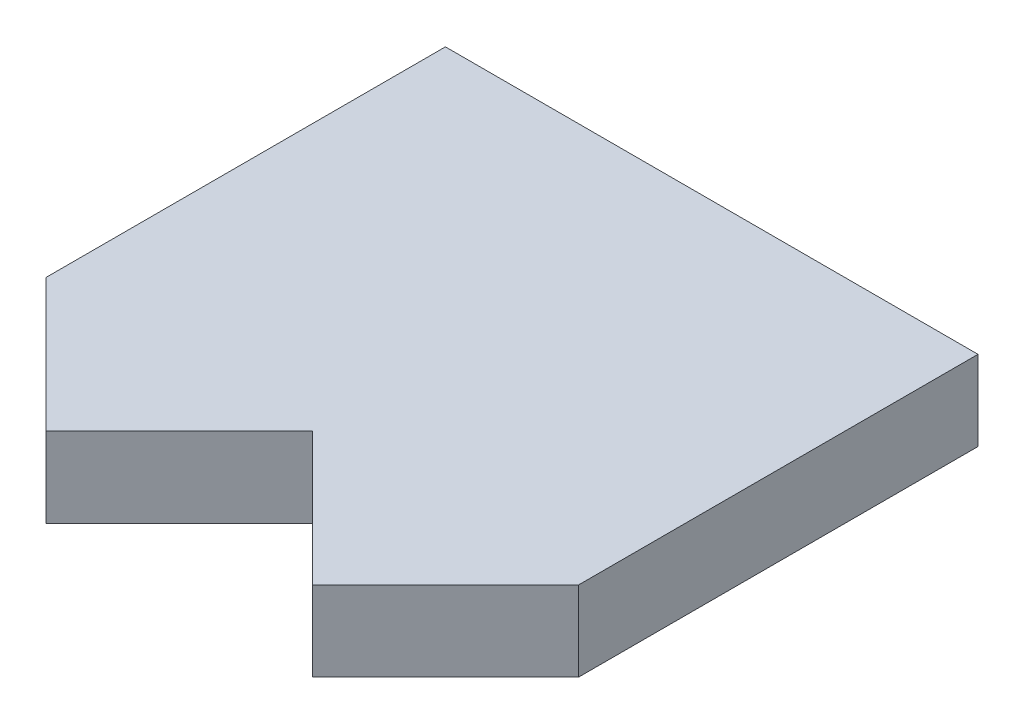
ISO-10303-21;
HEADER;
FILE_DESCRIPTION(('STEP AP214'),'2;1');
FILE_NAME('part.step','',(''),(''),'','','');
FILE_SCHEMA(('AUTOMOTIVE_DESIGN { 1 0 10303 214 1 1 1 1 }'));
ENDSEC;
DATA;
#1=APPLICATION_CONTEXT('core data for automotive mechanical design processes');
#2=APPLICATION_PROTOCOL_DEFINITION('international standard','automotive_design',2000,#1);
#3=PRODUCT_CONTEXT('',#1,'mechanical');
#4=PRODUCT('Part','Part','',(#3));
#5=PRODUCT_RELATED_PRODUCT_CATEGORY('part','',(#4));
#6=PRODUCT_DEFINITION_FORMATION('','',#4);
#7=PRODUCT_DEFINITION_CONTEXT('part definition',#1,'design');
#8=PRODUCT_DEFINITION('design','',#6,#7);
#9=PRODUCT_DEFINITION_SHAPE('','',#8);
#10=(LENGTH_UNIT() NAMED_UNIT(*) SI_UNIT(.MILLI.,.METRE.));
#11=(NAMED_UNIT(*) PLANE_ANGLE_UNIT() SI_UNIT($,.RADIAN.));
#12=(NAMED_UNIT(*) SI_UNIT($,.STERADIAN.) SOLID_ANGLE_UNIT());
#13=UNCERTAINTY_MEASURE_WITH_UNIT(LENGTH_MEASURE(1.E-05),#10,'distance_accuracy_value','');
#14=(GEOMETRIC_REPRESENTATION_CONTEXT(3) GLOBAL_UNCERTAINTY_ASSIGNED_CONTEXT((#13)) GLOBAL_UNIT_ASSIGNED_CONTEXT((#10,
#11,#12)) REPRESENTATION_CONTEXT('',''));
#15=CARTESIAN_POINT('',(0.,0.,0.));
#16=DIRECTION('',(0.,0.,1.));
#17=DIRECTION('',(1.,0.,0.));
#18=AXIS2_PLACEMENT_3D('',#15,#16,#17);
#19=CARTESIAN_POINT('',(0.,3.,0.));
#20=DIRECTION('',(0.,-1.,0.));
#21=DIRECTION('',(0.,0.,-1.));
#22=AXIS2_PLACEMENT_3D('',#19,#20,#21);
#23=PLANE('',#22);
#24=DIRECTION('',(-0.707106781186548,0.,-0.707106781186547));
#25=VECTOR('',#24,1.);
#26=CARTESIAN_POINT('',(-2.5,3.,2.5));
#27=LINE('',#26,#25);
#28=CARTESIAN_POINT('',(5.,3.,9.99999999999999));
#29=VERTEX_POINT('',#28);
#30=CARTESIAN_POINT('',(0.,3.,5.));
#31=VERTEX_POINT('',#30);
#32=EDGE_CURVE('E180',#29,#31,#27,.T.);
#33=ORIENTED_EDGE('',*,*,#32,.F.);
#34=DIRECTION('',(-0.707106781186548,0.,0.707106781186548));
#35=VECTOR('',#34,1.);
#36=CARTESIAN_POINT('',(7.5,3.,7.5));
#37=LINE('',#36,#35);
#38=CARTESIAN_POINT('',(10.,3.,5.));
#39=VERTEX_POINT('',#38);
#40=EDGE_CURVE('E170',#39,#29,#37,.T.);
#41=ORIENTED_EDGE('',*,*,#40,.F.);
#42=DIRECTION('',(0.,0.,-1.));
#43=VECTOR('',#42,1.);
#44=CARTESIAN_POINT('',(10.,3.,10.));
#45=LINE('',#44,#43);
#46=CARTESIAN_POINT('',(10.,3.,-10.));
#47=VERTEX_POINT('',#46);
#48=EDGE_CURVE('E161',#39,#47,#45,.T.);
#49=ORIENTED_EDGE('',*,*,#48,.T.);
#50=DIRECTION('',(-1.,0.,0.));
#51=VECTOR('',#50,1.);
#52=CARTESIAN_POINT('',(-10.,3.,-10.));
#53=LINE('',#52,#51);
#54=CARTESIAN_POINT('',(-10.,3.,-10.));
#55=VERTEX_POINT('',#54);
#56=EDGE_CURVE('E130',#47,#55,#53,.T.);
#57=ORIENTED_EDGE('',*,*,#56,.T.);
#58=DIRECTION('',(0.,0.,1.));
#59=VECTOR('',#58,1.);
#60=CARTESIAN_POINT('',(-10.,3.,10.));
#61=LINE('',#60,#59);
#62=CARTESIAN_POINT('',(-10.,3.,4.99999999999999));
#63=VERTEX_POINT('',#62);
#64=EDGE_CURVE('E156',#55,#63,#61,.T.);
#65=ORIENTED_EDGE('',*,*,#64,.T.);
#66=DIRECTION('',(-0.707106781186548,0.,-0.707106781186548));
#67=VECTOR('',#66,1.);
#68=CARTESIAN_POINT('',(-7.5,3.,7.5));
#69=LINE('',#68,#67);
#70=CARTESIAN_POINT('',(-5.,3.,10.));
#71=VERTEX_POINT('',#70);
#72=EDGE_CURVE('E166',#71,#63,#69,.T.);
#73=ORIENTED_EDGE('',*,*,#72,.F.);
#74=DIRECTION('',(-0.707106781186547,0.,0.707106781186548));
#75=VECTOR('',#74,1.);
#76=CARTESIAN_POINT('',(2.5,3.,2.5));
#77=LINE('',#76,#75);
#78=EDGE_CURVE('E187',#31,#71,#77,.T.);
#79=ORIENTED_EDGE('',*,*,#78,.F.);
#80=EDGE_LOOP('',(#33,#41,#49,#57,#65,#73,#79));
#81=FACE_BOUND('',#80,.T.);
#82=ADVANCED_FACE('F106',(#81),#23,.F.);
#83=CARTESIAN_POINT('',(0.,0.,0.));
#84=DIRECTION('',(0.,-1.,0.));
#85=DIRECTION('',(0.,0.,-1.));
#86=AXIS2_PLACEMENT_3D('',#83,#84,#85);
#87=PLANE('',#86);
#88=DIRECTION('',(0.707106781186548,0.,-0.707106781186548));
#89=VECTOR('',#88,1.);
#90=CARTESIAN_POINT('',(7.5,0.,7.5));
#91=LINE('',#90,#89);
#92=CARTESIAN_POINT('',(5.,0.,9.99999999999999));
#93=VERTEX_POINT('',#92);
#94=CARTESIAN_POINT('',(10.,0.,5.));
#95=VERTEX_POINT('',#94);
#96=EDGE_CURVE('E177',#93,#95,#91,.T.);
#97=ORIENTED_EDGE('',*,*,#96,.F.);
#98=DIRECTION('',(0.707106781186548,0.,0.707106781186547));
#99=VECTOR('',#98,1.);
#100=CARTESIAN_POINT('',(-2.5,0.,2.5));
#101=LINE('',#100,#99);
#102=CARTESIAN_POINT('',(0.,0.,5.));
#103=VERTEX_POINT('',#102);
#104=EDGE_CURVE('E199',#103,#93,#101,.T.);
#105=ORIENTED_EDGE('',*,*,#104,.F.);
#106=DIRECTION('',(0.707106781186547,0.,-0.707106781186548));
#107=VECTOR('',#106,1.);
#108=CARTESIAN_POINT('',(2.5,0.,2.5));
#109=LINE('',#108,#107);
#110=CARTESIAN_POINT('',(-5.,0.,10.));
#111=VERTEX_POINT('',#110);
#112=EDGE_CURVE('E194',#111,#103,#109,.T.);
#113=ORIENTED_EDGE('',*,*,#112,.F.);
#114=DIRECTION('',(0.707106781186548,0.,0.707106781186548));
#115=VECTOR('',#114,1.);
#116=CARTESIAN_POINT('',(-7.5,0.,7.5));
#117=LINE('',#116,#115);
#118=CARTESIAN_POINT('',(-10.,0.,4.99999999999999));
#119=VERTEX_POINT('',#118);
#120=EDGE_CURVE('E160',#119,#111,#117,.T.);
#121=ORIENTED_EDGE('',*,*,#120,.F.);
#122=DIRECTION('',(0.,0.,1.));
#123=VECTOR('',#122,1.);
#124=CARTESIAN_POINT('',(-10.,0.,10.));
#125=LINE('',#124,#123);
#126=CARTESIAN_POINT('',(-10.,0.,-10.));
#127=VERTEX_POINT('',#126);
#128=EDGE_CURVE('E150',#127,#119,#125,.T.);
#129=ORIENTED_EDGE('',*,*,#128,.F.);
#130=DIRECTION('',(-1.,0.,0.));
#131=VECTOR('',#130,1.);
#132=CARTESIAN_POINT('',(-10.,0.,-10.));
#133=LINE('',#132,#131);
#134=CARTESIAN_POINT('',(10.,0.,-10.));
#135=VERTEX_POINT('',#134);
#136=EDGE_CURVE('E142',#135,#127,#133,.T.);
#137=ORIENTED_EDGE('',*,*,#136,.F.);
#138=DIRECTION('',(0.,0.,-1.));
#139=VECTOR('',#138,1.);
#140=CARTESIAN_POINT('',(10.,0.,10.));
#141=LINE('',#140,#139);
#142=EDGE_CURVE('E151',#95,#135,#141,.T.);
#143=ORIENTED_EDGE('',*,*,#142,.F.);
#144=EDGE_LOOP('',(#97,#105,#113,#121,#129,#137,#143));
#145=FACE_BOUND('',#144,.T.);
#146=ADVANCED_FACE('F158',(#145),#87,.T.);
#147=CARTESIAN_POINT('',(10.,3.,10.));
#148=DIRECTION('',(-1.,0.,0.));
#149=DIRECTION('',(0.,0.,1.));
#150=AXIS2_PLACEMENT_3D('',#147,#148,#149);
#151=PLANE('',#150);
#152=DIRECTION('',(0.,1.,0.));
#153=VECTOR('',#152,1.);
#154=CARTESIAN_POINT('',(10.,0.,5.));
#155=LINE('',#154,#153);
#156=EDGE_CURVE('E174',#95,#39,#155,.T.);
#157=ORIENTED_EDGE('',*,*,#156,.F.);
#158=ORIENTED_EDGE('',*,*,#142,.T.);
#159=DIRECTION('',(0.,-1.,0.));
#160=VECTOR('',#159,1.);
#161=CARTESIAN_POINT('',(10.,3.,-10.));
#162=LINE('',#161,#160);
#163=EDGE_CURVE('E12',#47,#135,#162,.T.);
#164=ORIENTED_EDGE('',*,*,#163,.F.);
#165=ORIENTED_EDGE('',*,*,#48,.F.);
#166=EDGE_LOOP('',(#157,#158,#164,#165));
#167=FACE_BOUND('',#166,.T.);
#168=ADVANCED_FACE('F108',(#167),#151,.F.);
#169=CARTESIAN_POINT('',(-10.,3.,10.));
#170=DIRECTION('',(1.,0.,0.));
#171=DIRECTION('',(0.,0.,-1.));
#172=AXIS2_PLACEMENT_3D('',#169,#170,#171);
#173=PLANE('',#172);
#174=DIRECTION('',(0.,1.,0.));
#175=VECTOR('',#174,1.);
#176=CARTESIAN_POINT('',(-10.,0.,4.99999999999999));
#177=LINE('',#176,#175);
#178=EDGE_CURVE('E121',#119,#63,#177,.T.);
#179=ORIENTED_EDGE('',*,*,#178,.T.);
#180=ORIENTED_EDGE('',*,*,#64,.F.);
#181=DIRECTION('',(0.,-1.,0.));
#182=VECTOR('',#181,1.);
#183=CARTESIAN_POINT('',(-10.,3.,-10.));
#184=LINE('',#183,#182);
#185=EDGE_CURVE('E114',#55,#127,#184,.T.);
#186=ORIENTED_EDGE('',*,*,#185,.T.);
#187=ORIENTED_EDGE('',*,*,#128,.T.);
#188=EDGE_LOOP('',(#179,#180,#186,#187));
#189=FACE_BOUND('',#188,.T.);
#190=ADVANCED_FACE('F155',(#189),#173,.F.);
#191=CARTESIAN_POINT('',(-10.,3.,-10.));
#192=DIRECTION('',(0.,0.,1.));
#193=DIRECTION('',(1.,0.,0.));
#194=AXIS2_PLACEMENT_3D('',#191,#192,#193);
#195=PLANE('',#194);
#196=ORIENTED_EDGE('',*,*,#136,.T.);
#197=ORIENTED_EDGE('',*,*,#185,.F.);
#198=ORIENTED_EDGE('',*,*,#56,.F.);
#199=ORIENTED_EDGE('',*,*,#163,.T.);
#200=EDGE_LOOP('',(#196,#197,#198,#199));
#201=FACE_BOUND('',#200,.T.);
#202=ADVANCED_FACE('F144',(#201),#195,.F.);
#203=CARTESIAN_POINT('',(7.5,0.,7.5));
#204=DIRECTION('',(0.707106781186547,0.,0.707106781186547));
#205=DIRECTION('',(0.707106781186548,0.,-0.707106781186548));
#206=AXIS2_PLACEMENT_3D('',#203,#204,#205);
#207=PLANE('',#206);
#208=ORIENTED_EDGE('',*,*,#40,.T.);
#209=DIRECTION('',(0.,1.,0.));
#210=VECTOR('',#209,1.);
#211=CARTESIAN_POINT('',(5.,0.,9.99999999999999));
#212=LINE('',#211,#210);
#213=EDGE_CURVE('E190',#93,#29,#212,.T.);
#214=ORIENTED_EDGE('',*,*,#213,.F.);
#215=ORIENTED_EDGE('',*,*,#96,.T.);
#216=ORIENTED_EDGE('',*,*,#156,.T.);
#217=EDGE_LOOP('',(#208,#214,#215,#216));
#218=FACE_BOUND('',#217,.T.);
#219=ADVANCED_FACE('F214',(#218),#207,.T.);
#220=CARTESIAN_POINT('',(-7.5,0.,7.5));
#221=DIRECTION('',(-0.707106781186547,0.,0.707106781186547));
#222=DIRECTION('',(0.707106781186548,0.,0.707106781186548));
#223=AXIS2_PLACEMENT_3D('',#220,#221,#222);
#224=PLANE('',#223);
#225=ORIENTED_EDGE('',*,*,#72,.T.);
#226=ORIENTED_EDGE('',*,*,#178,.F.);
#227=ORIENTED_EDGE('',*,*,#120,.T.);
#228=DIRECTION('',(0.,1.,0.));
#229=VECTOR('',#228,1.);
#230=CARTESIAN_POINT('',(-5.,0.,10.));
#231=LINE('',#230,#229);
#232=EDGE_CURVE('E173',#111,#71,#231,.T.);
#233=ORIENTED_EDGE('',*,*,#232,.T.);
#234=EDGE_LOOP('',(#225,#226,#227,#233));
#235=FACE_BOUND('',#234,.T.);
#236=ADVANCED_FACE('F233',(#235),#224,.T.);
#237=CARTESIAN_POINT('',(-2.5,0.,2.5));
#238=DIRECTION('',(-0.707106781186547,0.,0.707106781186548));
#239=DIRECTION('',(0.707106781186548,0.,0.707106781186547));
#240=AXIS2_PLACEMENT_3D('',#237,#238,#239);
#241=PLANE('',#240);
#242=ORIENTED_EDGE('',*,*,#32,.T.);
#243=DIRECTION('',(0.,1.,0.));
#244=VECTOR('',#243,1.);
#245=CARTESIAN_POINT('',(0.,0.,5.));
#246=LINE('',#245,#244);
#247=EDGE_CURVE('E191',#103,#31,#246,.T.);
#248=ORIENTED_EDGE('',*,*,#247,.F.);
#249=ORIENTED_EDGE('',*,*,#104,.T.);
#250=ORIENTED_EDGE('',*,*,#213,.T.);
#251=EDGE_LOOP('',(#242,#248,#249,#250));
#252=FACE_BOUND('',#251,.T.);
#253=ADVANCED_FACE('F206',(#252),#241,.T.);
#254=CARTESIAN_POINT('',(2.5,0.,2.5));
#255=DIRECTION('',(0.707106781186548,0.,0.707106781186547));
#256=DIRECTION('',(0.707106781186547,0.,-0.707106781186548));
#257=AXIS2_PLACEMENT_3D('',#254,#255,#256);
#258=PLANE('',#257);
#259=ORIENTED_EDGE('',*,*,#78,.T.);
#260=ORIENTED_EDGE('',*,*,#232,.F.);
#261=ORIENTED_EDGE('',*,*,#112,.T.);
#262=ORIENTED_EDGE('',*,*,#247,.T.);
#263=EDGE_LOOP('',(#259,#260,#261,#262));
#264=FACE_BOUND('',#263,.T.);
#265=ADVANCED_FACE('F229',(#264),#258,.T.);
#266=CLOSED_SHELL('',(#82,#146,#168,#190,#202,#219,#236,#253,#265));
#267=MANIFOLD_SOLID_BREP('B2',#266);
#268=ADVANCED_BREP_SHAPE_REPRESENTATION('',(#18,#267),#14);
#269=SHAPE_DEFINITION_REPRESENTATION(#9,#268);
ENDSEC;
END-ISO-10303-21;
